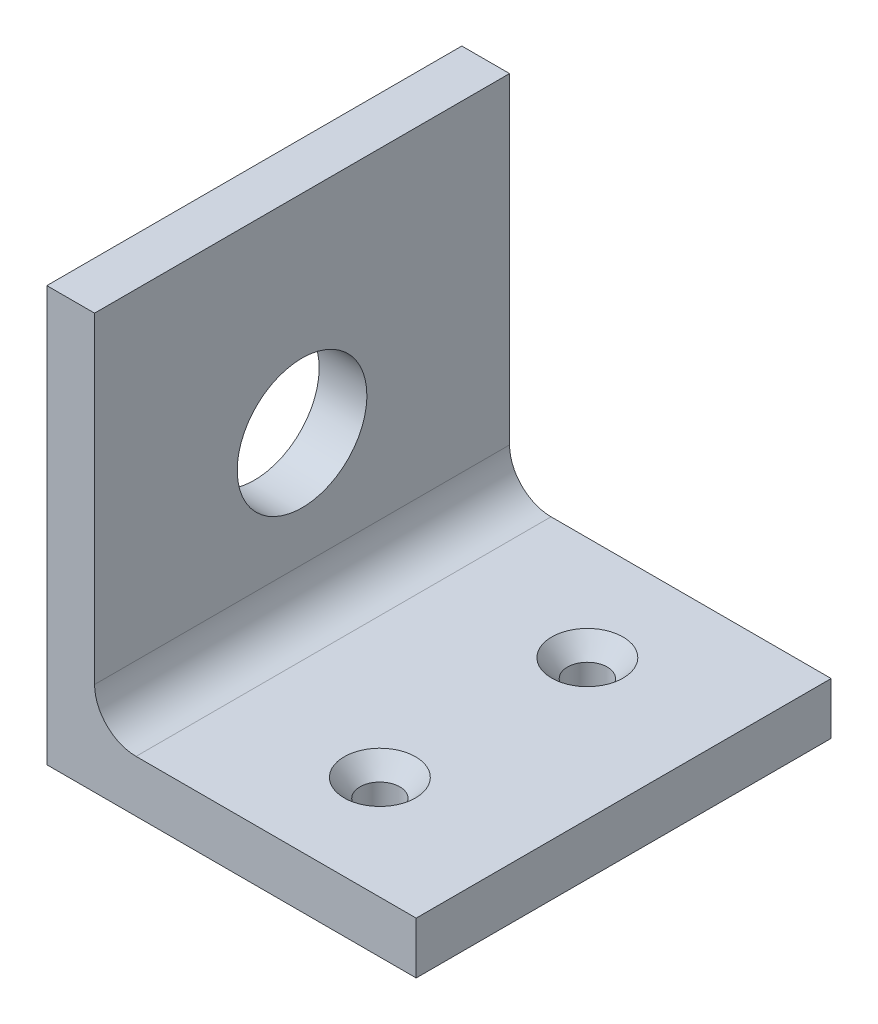
ISO-10303-21;
HEADER;
FILE_DESCRIPTION(('STEP AP214'),'2;1');
FILE_NAME('part.step','',(''),(''),'','','');
FILE_SCHEMA(('AUTOMOTIVE_DESIGN { 1 0 10303 214 1 1 1 1 }'));
ENDSEC;
DATA;
#1=APPLICATION_CONTEXT('core data for automotive mechanical design processes');
#2=APPLICATION_PROTOCOL_DEFINITION('international standard','automotive_design',2000,#1);
#3=PRODUCT_CONTEXT('',#1,'mechanical');
#4=PRODUCT('Part','Part','',(#3));
#5=PRODUCT_RELATED_PRODUCT_CATEGORY('part','',(#4));
#6=PRODUCT_DEFINITION_FORMATION('','',#4);
#7=PRODUCT_DEFINITION_CONTEXT('part definition',#1,'design');
#8=PRODUCT_DEFINITION('design','',#6,#7);
#9=PRODUCT_DEFINITION_SHAPE('','',#8);
#10=(LENGTH_UNIT() NAMED_UNIT(*) SI_UNIT(.MILLI.,.METRE.));
#11=(NAMED_UNIT(*) PLANE_ANGLE_UNIT() SI_UNIT($,.RADIAN.));
#12=(NAMED_UNIT(*) SI_UNIT($,.STERADIAN.) SOLID_ANGLE_UNIT());
#13=UNCERTAINTY_MEASURE_WITH_UNIT(LENGTH_MEASURE(1.E-05),#10,'distance_accuracy_value','');
#14=(GEOMETRIC_REPRESENTATION_CONTEXT(3) GLOBAL_UNCERTAINTY_ASSIGNED_CONTEXT((#13)) GLOBAL_UNIT_ASSIGNED_CONTEXT((#10,
#11,#12)) REPRESENTATION_CONTEXT('',''));
#15=CARTESIAN_POINT('',(0.,0.,0.));
#16=DIRECTION('',(0.,0.,1.));
#17=DIRECTION('',(1.,0.,0.));
#18=AXIS2_PLACEMENT_3D('',#15,#16,#17);
#19=CARTESIAN_POINT('',(0.,0.,25.4));
#20=DIRECTION('',(0.,1.,0.));
#21=DIRECTION('',(0.,0.,1.));
#22=AXIS2_PLACEMENT_3D('',#19,#20,#21);
#23=PLANE('',#22);
#24=CARTESIAN_POINT('',(14.2875,0.,19.05));
#25=DIRECTION('',(0.,1.,0.));
#26=DIRECTION('',(0.,0.,1.));
#27=AXIS2_PLACEMENT_3D('',#24,#25,#26);
#28=CIRCLE('',#27,1.21919999999999);
#29=CARTESIAN_POINT('',(14.2875,0.,20.2692));
#30=VERTEX_POINT('',#29);
#31=EDGE_CURVE('E173',#30,#30,#28,.T.);
#32=ORIENTED_EDGE('',*,*,#31,.T.);
#33=EDGE_LOOP('',(#32));
#34=FACE_BOUND('',#33,.T.);
#35=CARTESIAN_POINT('',(14.2875,0.,6.35));
#36=DIRECTION('',(0.,1.,0.));
#37=DIRECTION('',(0.,0.,1.));
#38=AXIS2_PLACEMENT_3D('',#35,#36,#37);
#39=CIRCLE('',#38,1.21919999999999);
#40=CARTESIAN_POINT('',(14.2875,0.,7.56919999999999));
#41=VERTEX_POINT('',#40);
#42=EDGE_CURVE('E181',#41,#41,#39,.T.);
#43=ORIENTED_EDGE('',*,*,#42,.T.);
#44=EDGE_LOOP('',(#43));
#45=FACE_BOUND('',#44,.T.);
#46=DIRECTION('',(1.,0.,0.));
#47=VECTOR('',#46,1.);
#48=CARTESIAN_POINT('',(0.,0.,25.4));
#49=LINE('',#48,#47);
#50=CARTESIAN_POINT('',(0.254000000000003,0.,25.4));
#51=VERTEX_POINT('',#50);
#52=CARTESIAN_POINT('',(22.86,0.,25.4));
#53=VERTEX_POINT('',#52);
#54=EDGE_CURVE('E105',#51,#53,#49,.T.);
#55=ORIENTED_EDGE('',*,*,#54,.F.);
#56=DIRECTION('',(0.,0.,-1.));
#57=VECTOR('',#56,1.);
#58=CARTESIAN_POINT('',(0.254,0.,0.));
#59=LINE('',#58,#57);
#60=CARTESIAN_POINT('',(0.254,0.,0.));
#61=VERTEX_POINT('',#60);
#62=EDGE_CURVE('E91',#51,#61,#59,.T.);
#63=ORIENTED_EDGE('',*,*,#62,.T.);
#64=DIRECTION('',(1.,0.,0.));
#65=VECTOR('',#64,1.);
#66=CARTESIAN_POINT('',(0.,0.,0.));
#67=LINE('',#66,#65);
#68=CARTESIAN_POINT('',(22.86,0.,0.));
#69=VERTEX_POINT('',#68);
#70=EDGE_CURVE('E129',#61,#69,#67,.T.);
#71=ORIENTED_EDGE('',*,*,#70,.T.);
#72=DIRECTION('',(0.,0.,1.));
#73=VECTOR('',#72,1.);
#74=CARTESIAN_POINT('',(22.86,0.,25.4));
#75=LINE('',#74,#73);
#76=EDGE_CURVE('E112',#69,#53,#75,.T.);
#77=ORIENTED_EDGE('',*,*,#76,.T.);
#78=EDGE_LOOP('',(#55,#63,#71,#77));
#79=FACE_BOUND('',#78,.T.);
#80=ADVANCED_FACE('F34',(#34,#45,#79),#23,.F.);
#81=CARTESIAN_POINT('',(25.4,3.175,25.4));
#82=DIRECTION('',(0.,-1.,0.));
#83=DIRECTION('',(1.,0.,0.));
#84=AXIS2_PLACEMENT_3D('',#81,#82,#83);
#85=PLANE('',#84);
#86=CARTESIAN_POINT('',(14.2875,3.175,19.05));
#87=DIRECTION('',(0.,1.,0.));
#88=DIRECTION('',(0.,0.,1.));
#89=AXIS2_PLACEMENT_3D('',#86,#87,#88);
#90=CIRCLE('',#89,2.1844);
#91=CARTESIAN_POINT('',(14.2875,3.175,21.2344));
#92=VERTEX_POINT('',#91);
#93=EDGE_CURVE('E166',#92,#92,#90,.T.);
#94=ORIENTED_EDGE('',*,*,#93,.F.);
#95=EDGE_LOOP('',(#94));
#96=FACE_BOUND('',#95,.T.);
#97=CARTESIAN_POINT('',(14.2875,3.175,6.35));
#98=DIRECTION('',(0.,1.,0.));
#99=DIRECTION('',(0.,0.,1.));
#100=AXIS2_PLACEMENT_3D('',#97,#98,#99);
#101=CIRCLE('',#100,2.1844);
#102=CARTESIAN_POINT('',(14.2875,3.175,8.5344));
#103=VERTEX_POINT('',#102);
#104=EDGE_CURVE('E176',#103,#103,#101,.T.);
#105=ORIENTED_EDGE('',*,*,#104,.F.);
#106=EDGE_LOOP('',(#105));
#107=FACE_BOUND('',#106,.T.);
#108=DIRECTION('',(-1.,0.,0.));
#109=VECTOR('',#108,1.);
#110=CARTESIAN_POINT('',(25.4,3.175,0.));
#111=LINE('',#110,#109);
#112=CARTESIAN_POINT('',(22.86,3.175,0.));
#113=VERTEX_POINT('',#112);
#114=CARTESIAN_POINT('',(5.715,3.175,0.));
#115=VERTEX_POINT('',#114);
#116=EDGE_CURVE('E131',#113,#115,#111,.T.);
#117=ORIENTED_EDGE('',*,*,#116,.T.);
#118=DIRECTION('',(0.,0.,-1.));
#119=VECTOR('',#118,1.);
#120=CARTESIAN_POINT('',(5.715,3.175,25.4));
#121=LINE('',#120,#119);
#122=CARTESIAN_POINT('',(5.715,3.175,25.4));
#123=VERTEX_POINT('',#122);
#124=EDGE_CURVE('E139',#115,#123,#121,.F.);
#125=ORIENTED_EDGE('',*,*,#124,.T.);
#126=DIRECTION('',(-1.,0.,0.));
#127=VECTOR('',#126,1.);
#128=CARTESIAN_POINT('',(25.4,3.175,25.4));
#129=LINE('',#128,#127);
#130=CARTESIAN_POINT('',(22.86,3.175,25.4));
#131=VERTEX_POINT('',#130);
#132=EDGE_CURVE('E113',#131,#123,#129,.T.);
#133=ORIENTED_EDGE('',*,*,#132,.F.);
#134=DIRECTION('',(0.,0.,1.));
#135=VECTOR('',#134,1.);
#136=CARTESIAN_POINT('',(22.86,3.175,25.4));
#137=LINE('',#136,#135);
#138=EDGE_CURVE('E163',#113,#131,#137,.T.);
#139=ORIENTED_EDGE('',*,*,#138,.F.);
#140=EDGE_LOOP('',(#117,#125,#133,#139));
#141=FACE_BOUND('',#140,.T.);
#142=ADVANCED_FACE('F144',(#96,#107,#141),#85,.F.);
#143=CARTESIAN_POINT('',(3.175,3.175,25.4));
#144=DIRECTION('',(-1.,0.,0.));
#145=DIRECTION('',(0.,-1.,0.));
#146=AXIS2_PLACEMENT_3D('',#143,#144,#145);
#147=PLANE('',#146);
#148=CARTESIAN_POINT('',(3.175,12.7,12.7));
#149=DIRECTION('',(1.,0.,0.));
#150=DIRECTION('',(0.,1.,0.));
#151=AXIS2_PLACEMENT_3D('',#148,#149,#150);
#152=CIRCLE('',#151,3.96875);
#153=CARTESIAN_POINT('',(3.175,16.66875,12.7));
#154=VERTEX_POINT('',#153);
#155=EDGE_CURVE('E123',#154,#154,#152,.T.);
#156=ORIENTED_EDGE('',*,*,#155,.F.);
#157=EDGE_LOOP('',(#156));
#158=FACE_BOUND('',#157,.T.);
#159=DIRECTION('',(0.,1.,0.));
#160=VECTOR('',#159,1.);
#161=CARTESIAN_POINT('',(3.175,3.175,25.4));
#162=LINE('',#161,#160);
#163=CARTESIAN_POINT('',(3.175,5.715,25.4));
#164=VERTEX_POINT('',#163);
#165=CARTESIAN_POINT('',(3.175,25.4,25.4));
#166=VERTEX_POINT('',#165);
#167=EDGE_CURVE('E117',#164,#166,#162,.T.);
#168=ORIENTED_EDGE('',*,*,#167,.F.);
#169=DIRECTION('',(0.,0.,-1.));
#170=VECTOR('',#169,1.);
#171=CARTESIAN_POINT('',(3.175,5.715,0.));
#172=LINE('',#171,#170);
#173=CARTESIAN_POINT('',(3.175,5.715,0.));
#174=VERTEX_POINT('',#173);
#175=EDGE_CURVE('E136',#164,#174,#172,.T.);
#176=ORIENTED_EDGE('',*,*,#175,.T.);
#177=DIRECTION('',(0.,1.,0.));
#178=VECTOR('',#177,1.);
#179=CARTESIAN_POINT('',(3.175,3.175,0.));
#180=LINE('',#179,#178);
#181=CARTESIAN_POINT('',(3.175,25.4,0.));
#182=VERTEX_POINT('',#181);
#183=EDGE_CURVE('E120',#174,#182,#180,.T.);
#184=ORIENTED_EDGE('',*,*,#183,.T.);
#185=DIRECTION('',(0.,0.,-1.));
#186=VECTOR('',#185,1.);
#187=CARTESIAN_POINT('',(3.175,25.4,25.4));
#188=LINE('',#187,#186);
#189=EDGE_CURVE('E128',#166,#182,#188,.T.);
#190=ORIENTED_EDGE('',*,*,#189,.F.);
#191=EDGE_LOOP('',(#168,#176,#184,#190));
#192=FACE_BOUND('',#191,.T.);
#193=ADVANCED_FACE('F152',(#158,#192),#147,.F.);
#194=CARTESIAN_POINT('',(3.175,25.4,25.4));
#195=DIRECTION('',(0.,-1.,0.));
#196=DIRECTION('',(0.,0.,-1.));
#197=AXIS2_PLACEMENT_3D('',#194,#195,#196);
#198=PLANE('',#197);
#199=DIRECTION('',(-1.,0.,0.));
#200=VECTOR('',#199,1.);
#201=CARTESIAN_POINT('',(3.175,25.4,0.));
#202=LINE('',#201,#200);
#203=CARTESIAN_POINT('',(0.254000000000003,25.4,0.));
#204=VERTEX_POINT('',#203);
#205=EDGE_CURVE('E114',#182,#204,#202,.T.);
#206=ORIENTED_EDGE('',*,*,#205,.T.);
#207=DIRECTION('',(0.,0.,-1.));
#208=VECTOR('',#207,1.);
#209=CARTESIAN_POINT('',(0.254,25.4,0.));
#210=LINE('',#209,#208);
#211=CARTESIAN_POINT('',(0.254000000000003,25.4,25.4));
#212=VERTEX_POINT('',#211);
#213=EDGE_CURVE('E50',#212,#204,#210,.T.);
#214=ORIENTED_EDGE('',*,*,#213,.F.);
#215=DIRECTION('',(-1.,0.,0.));
#216=VECTOR('',#215,1.);
#217=CARTESIAN_POINT('',(3.175,25.4,25.4));
#218=LINE('',#217,#216);
#219=EDGE_CURVE('E108',#166,#212,#218,.T.);
#220=ORIENTED_EDGE('',*,*,#219,.F.);
#221=ORIENTED_EDGE('',*,*,#189,.T.);
#222=EDGE_LOOP('',(#206,#214,#220,#221));
#223=FACE_BOUND('',#222,.T.);
#224=ADVANCED_FACE('F157',(#223),#198,.F.);
#225=CARTESIAN_POINT('',(0.,0.,25.4));
#226=DIRECTION('',(0.,0.,1.));
#227=DIRECTION('',(1.,0.,0.));
#228=AXIS2_PLACEMENT_3D('',#225,#226,#227);
#229=PLANE('',#228);
#230=DIRECTION('',(0.,1.,0.));
#231=VECTOR('',#230,1.);
#232=CARTESIAN_POINT('',(0.254000000000003,0.,25.4));
#233=LINE('',#232,#231);
#234=EDGE_CURVE('E95',#51,#212,#233,.T.);
#235=ORIENTED_EDGE('',*,*,#234,.F.);
#236=ORIENTED_EDGE('',*,*,#54,.T.);
#237=DIRECTION('',(0.,1.,0.));
#238=VECTOR('',#237,1.);
#239=CARTESIAN_POINT('',(22.86,0.,25.4));
#240=LINE('',#239,#238);
#241=EDGE_CURVE('E149',#53,#131,#240,.T.);
#242=ORIENTED_EDGE('',*,*,#241,.T.);
#243=ORIENTED_EDGE('',*,*,#132,.T.);
#244=CARTESIAN_POINT('',(5.715,5.715,25.4));
#245=DIRECTION('',(0.,0.,1.));
#246=DIRECTION('',(1.,0.,0.));
#247=AXIS2_PLACEMENT_3D('',#244,#245,#246);
#248=CIRCLE('',#247,2.54);
#249=EDGE_CURVE('E11',#123,#164,#248,.F.);
#250=ORIENTED_EDGE('',*,*,#249,.T.);
#251=ORIENTED_EDGE('',*,*,#167,.T.);
#252=ORIENTED_EDGE('',*,*,#219,.T.);
#253=EDGE_LOOP('',(#235,#236,#242,#243,#250,#251,#252));
#254=FACE_BOUND('',#253,.T.);
#255=ADVANCED_FACE('F103',(#254),#229,.T.);
#256=CARTESIAN_POINT('',(0.,0.,0.));
#257=DIRECTION('',(0.,0.,1.));
#258=DIRECTION('',(1.,0.,0.));
#259=AXIS2_PLACEMENT_3D('',#256,#257,#258);
#260=PLANE('',#259);
#261=ORIENTED_EDGE('',*,*,#70,.F.);
#262=DIRECTION('',(0.,1.,0.));
#263=VECTOR('',#262,1.);
#264=CARTESIAN_POINT('',(0.254,0.,0.));
#265=LINE('',#264,#263);
#266=EDGE_CURVE('E96',#61,#204,#265,.T.);
#267=ORIENTED_EDGE('',*,*,#266,.T.);
#268=ORIENTED_EDGE('',*,*,#205,.F.);
#269=ORIENTED_EDGE('',*,*,#183,.F.);
#270=CARTESIAN_POINT('',(5.715,5.715,0.));
#271=DIRECTION('',(0.,0.,1.));
#272=DIRECTION('',(1.,0.,0.));
#273=AXIS2_PLACEMENT_3D('',#270,#271,#272);
#274=CIRCLE('',#273,2.54);
#275=EDGE_CURVE('E43',#174,#115,#274,.T.);
#276=ORIENTED_EDGE('',*,*,#275,.T.);
#277=ORIENTED_EDGE('',*,*,#116,.F.);
#278=DIRECTION('',(0.,1.,0.));
#279=VECTOR('',#278,1.);
#280=CARTESIAN_POINT('',(22.86,0.,0.));
#281=LINE('',#280,#279);
#282=EDGE_CURVE('E162',#69,#113,#281,.T.);
#283=ORIENTED_EDGE('',*,*,#282,.F.);
#284=EDGE_LOOP('',(#261,#267,#268,#269,#276,#277,#283));
#285=FACE_BOUND('',#284,.T.);
#286=ADVANCED_FACE('F155',(#285),#260,.F.);
#287=CARTESIAN_POINT('',(0.,12.7,12.7));
#288=DIRECTION('',(1.,0.,0.));
#289=DIRECTION('',(0.,1.,0.));
#290=AXIS2_PLACEMENT_3D('',#287,#288,#289);
#291=CYLINDRICAL_SURFACE('',#290,3.96875);
#292=CARTESIAN_POINT('',(0.254000000000001,12.7,12.7));
#293=DIRECTION('',(1.,0.,0.));
#294=DIRECTION('',(0.,0.,-1.));
#295=AXIS2_PLACEMENT_3D('',#292,#293,#294);
#296=CIRCLE('',#295,3.96875);
#297=CARTESIAN_POINT('',(0.254000000000001,12.7,8.73125));
#298=VERTEX_POINT('',#297);
#299=EDGE_CURVE('E38',#298,#298,#296,.F.);
#300=ORIENTED_EDGE('',*,*,#299,.T.);
#301=EDGE_LOOP('',(#300));
#302=FACE_BOUND('',#301,.T.);
#303=ORIENTED_EDGE('',*,*,#155,.T.);
#304=EDGE_LOOP('',(#303));
#305=FACE_BOUND('',#304,.T.);
#306=ADVANCED_FACE('F188',(#302,#305),#291,.F.);
#307=CARTESIAN_POINT('',(14.2875,3.175,6.35));
#308=DIRECTION('',(0.,1.,0.));
#309=DIRECTION('',(0.,0.,1.));
#310=AXIS2_PLACEMENT_3D('',#307,#308,#309);
#311=CYLINDRICAL_SURFACE('',#310,1.21919999999999);
#312=ORIENTED_EDGE('',*,*,#42,.F.);
#313=EDGE_LOOP('',(#312));
#314=FACE_BOUND('',#313,.T.);
#315=CARTESIAN_POINT('',(14.2875,2.06466441335028,6.35));
#316=DIRECTION('',(0.,1.,0.));
#317=DIRECTION('',(0.,0.,1.));
#318=AXIS2_PLACEMENT_3D('',#315,#316,#317);
#319=CIRCLE('',#318,1.21919999999999);
#320=CARTESIAN_POINT('',(14.2875,2.06466441335028,7.56919999999999));
#321=VERTEX_POINT('',#320);
#322=EDGE_CURVE('E179',#321,#321,#319,.T.);
#323=ORIENTED_EDGE('',*,*,#322,.T.);
#324=EDGE_LOOP('',(#323));
#325=FACE_BOUND('',#324,.T.);
#326=ADVANCED_FACE('F222',(#314,#325),#311,.F.);
#327=CARTESIAN_POINT('',(14.2875,3.175,6.35));
#328=DIRECTION('',(0.,1.,0.));
#329=DIRECTION('',(0.,0.,1.));
#330=AXIS2_PLACEMENT_3D('',#327,#328,#329);
#331=CONICAL_SURFACE('',#330,2.1844,0.715584993317679);
#332=ORIENTED_EDGE('',*,*,#322,.F.);
#333=EDGE_LOOP('',(#332));
#334=FACE_BOUND('',#333,.T.);
#335=ORIENTED_EDGE('',*,*,#104,.T.);
#336=EDGE_LOOP('',(#335));
#337=FACE_BOUND('',#336,.T.);
#338=ADVANCED_FACE('F209',(#334,#337),#331,.F.);
#339=CARTESIAN_POINT('',(14.2875,3.175,19.05));
#340=DIRECTION('',(0.,1.,0.));
#341=DIRECTION('',(0.,0.,1.));
#342=AXIS2_PLACEMENT_3D('',#339,#340,#341);
#343=CYLINDRICAL_SURFACE('',#342,1.21919999999999);
#344=ORIENTED_EDGE('',*,*,#31,.F.);
#345=EDGE_LOOP('',(#344));
#346=FACE_BOUND('',#345,.T.);
#347=CARTESIAN_POINT('',(14.2875,2.06466441335028,19.05));
#348=DIRECTION('',(0.,1.,0.));
#349=DIRECTION('',(0.,0.,1.));
#350=AXIS2_PLACEMENT_3D('',#347,#348,#349);
#351=CIRCLE('',#350,1.21919999999999);
#352=CARTESIAN_POINT('',(14.2875,2.06466441335028,20.2692));
#353=VERTEX_POINT('',#352);
#354=EDGE_CURVE('E170',#353,#353,#351,.T.);
#355=ORIENTED_EDGE('',*,*,#354,.T.);
#356=EDGE_LOOP('',(#355));
#357=FACE_BOUND('',#356,.T.);
#358=ADVANCED_FACE('F205',(#346,#357),#343,.F.);
#359=CARTESIAN_POINT('',(14.2875,3.175,19.05));
#360=DIRECTION('',(0.,1.,0.));
#361=DIRECTION('',(0.,0.,1.));
#362=AXIS2_PLACEMENT_3D('',#359,#360,#361);
#363=CONICAL_SURFACE('',#362,2.1844,0.71558499331768);
#364=ORIENTED_EDGE('',*,*,#354,.F.);
#365=EDGE_LOOP('',(#364));
#366=FACE_BOUND('',#365,.T.);
#367=ORIENTED_EDGE('',*,*,#93,.T.);
#368=EDGE_LOOP('',(#367));
#369=FACE_BOUND('',#368,.T.);
#370=ADVANCED_FACE('F208',(#366,#369),#363,.F.);
#371=CARTESIAN_POINT('',(22.86,0.,25.4));
#372=DIRECTION('',(-1.,0.,0.));
#373=DIRECTION('',(0.,-1.,0.));
#374=AXIS2_PLACEMENT_3D('',#371,#372,#373);
#375=PLANE('',#374);
#376=ORIENTED_EDGE('',*,*,#138,.T.);
#377=ORIENTED_EDGE('',*,*,#241,.F.);
#378=ORIENTED_EDGE('',*,*,#76,.F.);
#379=ORIENTED_EDGE('',*,*,#282,.T.);
#380=EDGE_LOOP('',(#376,#377,#378,#379));
#381=FACE_BOUND('',#380,.T.);
#382=ADVANCED_FACE('F215',(#381),#375,.F.);
#383=CARTESIAN_POINT('',(5.715,5.715,25.4));
#384=DIRECTION('',(0.,0.,1.));
#385=DIRECTION('',(1.,0.,0.));
#386=AXIS2_PLACEMENT_3D('',#383,#384,#385);
#387=CYLINDRICAL_SURFACE('',#386,2.54);
#388=ORIENTED_EDGE('',*,*,#249,.F.);
#389=ORIENTED_EDGE('',*,*,#124,.F.);
#390=ORIENTED_EDGE('',*,*,#275,.F.);
#391=ORIENTED_EDGE('',*,*,#175,.F.);
#392=EDGE_LOOP('',(#388,#389,#390,#391));
#393=FACE_BOUND('',#392,.T.);
#394=ADVANCED_FACE('F36',(#393),#387,.F.);
#395=CARTESIAN_POINT('',(0.254,0.,0.));
#396=DIRECTION('',(1.,0.,0.));
#397=DIRECTION('',(0.,0.,-1.));
#398=AXIS2_PLACEMENT_3D('',#395,#396,#397);
#399=PLANE('',#398);
#400=ORIENTED_EDGE('',*,*,#213,.T.);
#401=ORIENTED_EDGE('',*,*,#266,.F.);
#402=ORIENTED_EDGE('',*,*,#62,.F.);
#403=ORIENTED_EDGE('',*,*,#234,.T.);
#404=EDGE_LOOP('',(#400,#401,#402,#403));
#405=FACE_BOUND('',#404,.T.);
#406=ORIENTED_EDGE('',*,*,#299,.F.);
#407=EDGE_LOOP('',(#406));
#408=FACE_BOUND('',#407,.T.);
#409=ADVANCED_FACE('F93',(#405,#408),#399,.F.);
#410=CLOSED_SHELL('',(#80,#142,#193,#224,#255,#286,#306,#326,#338,#358,#370,#382,#394,#409));
#411=MANIFOLD_SOLID_BREP('B2',#410);
#412=ADVANCED_BREP_SHAPE_REPRESENTATION('',(#18,#411),#14);
#413=SHAPE_DEFINITION_REPRESENTATION(#9,#412);
ENDSEC;
END-ISO-10303-21;
